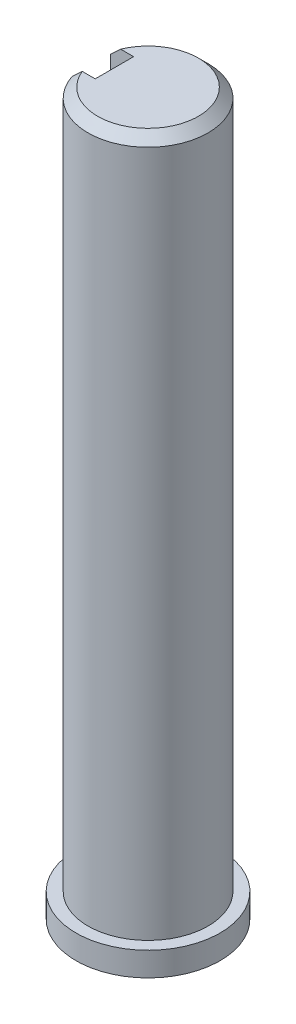
ISO-10303-21;
HEADER;
FILE_DESCRIPTION(('STEP AP214'),'2;1');
FILE_NAME('part.step','',(''),(''),'','','');
FILE_SCHEMA(('AUTOMOTIVE_DESIGN { 1 0 10303 214 1 1 1 1 }'));
ENDSEC;
DATA;
#1=APPLICATION_CONTEXT('core data for automotive mechanical design processes');
#2=APPLICATION_PROTOCOL_DEFINITION('international standard','automotive_design',2000,#1);
#3=PRODUCT_CONTEXT('',#1,'mechanical');
#4=PRODUCT('Part','Part','',(#3));
#5=PRODUCT_RELATED_PRODUCT_CATEGORY('part','',(#4));
#6=PRODUCT_DEFINITION_FORMATION('','',#4);
#7=PRODUCT_DEFINITION_CONTEXT('part definition',#1,'design');
#8=PRODUCT_DEFINITION('design','',#6,#7);
#9=PRODUCT_DEFINITION_SHAPE('','',#8);
#10=(LENGTH_UNIT() NAMED_UNIT(*) SI_UNIT(.MILLI.,.METRE.));
#11=(NAMED_UNIT(*) PLANE_ANGLE_UNIT() SI_UNIT($,.RADIAN.));
#12=(NAMED_UNIT(*) SI_UNIT($,.STERADIAN.) SOLID_ANGLE_UNIT());
#13=UNCERTAINTY_MEASURE_WITH_UNIT(LENGTH_MEASURE(1.E-05),#10,'distance_accuracy_value','');
#14=(GEOMETRIC_REPRESENTATION_CONTEXT(3) GLOBAL_UNCERTAINTY_ASSIGNED_CONTEXT((#13)) GLOBAL_UNIT_ASSIGNED_CONTEXT((#10,
#11,#12)) REPRESENTATION_CONTEXT('',''));
#15=CARTESIAN_POINT('',(0.,0.,0.));
#16=DIRECTION('',(0.,0.,1.));
#17=DIRECTION('',(1.,0.,0.));
#18=AXIS2_PLACEMENT_3D('',#15,#16,#17);
#19=CARTESIAN_POINT('',(0.,150.,0.));
#20=DIRECTION('',(0.,1.,0.));
#21=DIRECTION('',(0.,0.,1.));
#22=AXIS2_PLACEMENT_3D('',#19,#20,#21);
#23=PLANE('',#22);
#24=DIRECTION('',(1.,0.,0.));
#25=VECTOR('',#24,1.);
#26=CARTESIAN_POINT('',(-7.,150.,4.));
#27=LINE('',#26,#25);
#28=CARTESIAN_POINT('',(-9.70824391947378,150.,4.));
#29=VERTEX_POINT('',#28);
#30=CARTESIAN_POINT('',(-7.,150.,4.));
#31=VERTEX_POINT('',#30);
#32=EDGE_CURVE('E101',#29,#31,#27,.T.);
#33=ORIENTED_EDGE('',*,*,#32,.F.);
#34=CARTESIAN_POINT('',(0.,150.,0.));
#35=DIRECTION('',(0.,1.,0.));
#36=DIRECTION('',(0.,0.,1.));
#37=AXIS2_PLACEMENT_3D('',#34,#35,#36);
#38=CIRCLE('',#37,10.5);
#39=CARTESIAN_POINT('',(-9.70824391947378,150.,-4.));
#40=VERTEX_POINT('',#39);
#41=EDGE_CURVE('E48',#29,#40,#38,.T.);
#42=ORIENTED_EDGE('',*,*,#41,.T.);
#43=DIRECTION('',(-1.,0.,0.));
#44=VECTOR('',#43,1.);
#45=CARTESIAN_POINT('',(-7.,150.,-4.));
#46=LINE('',#45,#44);
#47=CARTESIAN_POINT('',(-7.,150.,-4.));
#48=VERTEX_POINT('',#47);
#49=EDGE_CURVE('E96',#48,#40,#46,.T.);
#50=ORIENTED_EDGE('',*,*,#49,.F.);
#51=DIRECTION('',(0.,0.,-1.));
#52=VECTOR('',#51,1.);
#53=CARTESIAN_POINT('',(-7.,150.,-4.));
#54=LINE('',#53,#52);
#55=EDGE_CURVE('E113',#31,#48,#54,.T.);
#56=ORIENTED_EDGE('',*,*,#55,.F.);
#57=EDGE_LOOP('',(#33,#42,#50,#56));
#58=FACE_BOUND('',#57,.T.);
#59=ADVANCED_FACE('F35',(#58),#23,.T.);
#60=CARTESIAN_POINT('',(0.,0.,0.));
#61=DIRECTION('',(0.,-1.,0.));
#62=DIRECTION('',(0.,0.,-1.));
#63=AXIS2_PLACEMENT_3D('',#60,#61,#62);
#64=CYLINDRICAL_SURFACE('',#63,12.5);
#65=DIRECTION('',(0.,-1.,0.));
#66=VECTOR('',#65,1.);
#67=CARTESIAN_POINT('',(-11.842719282327,0.,-4.));
#68=LINE('',#67,#66);
#69=CARTESIAN_POINT('',(-11.842719282327,148.,-4.));
#70=VERTEX_POINT('',#69);
#71=CARTESIAN_POINT('',(-11.842719282327,130.,-4.));
#72=VERTEX_POINT('',#71);
#73=EDGE_CURVE('E129',#70,#72,#68,.T.);
#74=ORIENTED_EDGE('',*,*,#73,.F.);
#75=CARTESIAN_POINT('',(0.,148.,0.));
#76=DIRECTION('',(0.,1.,0.));
#77=DIRECTION('',(0.,0.,1.));
#78=AXIS2_PLACEMENT_3D('',#75,#76,#77);
#79=CIRCLE('',#78,12.5);
#80=CARTESIAN_POINT('',(-11.842719282327,148.,4.));
#81=VERTEX_POINT('',#80);
#82=EDGE_CURVE('E131',#70,#81,#79,.F.);
#83=ORIENTED_EDGE('',*,*,#82,.T.);
#84=DIRECTION('',(0.,-1.,0.));
#85=VECTOR('',#84,1.);
#86=CARTESIAN_POINT('',(-11.842719282327,0.,4.));
#87=LINE('',#86,#85);
#88=CARTESIAN_POINT('',(-11.842719282327,130.,4.));
#89=VERTEX_POINT('',#88);
#90=EDGE_CURVE('E127',#89,#81,#87,.F.);
#91=ORIENTED_EDGE('',*,*,#90,.F.);
#92=CARTESIAN_POINT('',(0.,130.,0.));
#93=DIRECTION('',(0.,-1.,0.));
#94=DIRECTION('',(0.,0.,-1.));
#95=AXIS2_PLACEMENT_3D('',#92,#93,#94);
#96=CIRCLE('',#95,12.5);
#97=EDGE_CURVE('E94',#72,#89,#96,.F.);
#98=ORIENTED_EDGE('',*,*,#97,.F.);
#99=EDGE_LOOP('',(#74,#83,#91,#98));
#100=FACE_BOUND('',#99,.T.);
#101=CARTESIAN_POINT('',(0.,5.,0.));
#102=DIRECTION('',(0.,-1.,0.));
#103=DIRECTION('',(0.,0.,-1.));
#104=AXIS2_PLACEMENT_3D('',#101,#102,#103);
#105=CIRCLE('',#104,12.5);
#106=CARTESIAN_POINT('',(0.,5.,-12.5));
#107=VERTEX_POINT('',#106);
#108=EDGE_CURVE('E123',#107,#107,#105,.T.);
#109=ORIENTED_EDGE('',*,*,#108,.F.);
#110=EDGE_LOOP('',(#109));
#111=FACE_BOUND('',#110,.T.);
#112=ADVANCED_FACE('F154',(#100,#111),#64,.T.);
#113=CARTESIAN_POINT('',(12.5,5.,0.));
#114=DIRECTION('',(0.,1.,0.));
#115=DIRECTION('',(0.,0.,1.));
#116=AXIS2_PLACEMENT_3D('',#113,#114,#115);
#117=PLANE('',#116);
#118=ORIENTED_EDGE('',*,*,#108,.T.);
#119=EDGE_LOOP('',(#118));
#120=FACE_BOUND('',#119,.T.);
#121=CARTESIAN_POINT('',(0.,5.,0.));
#122=DIRECTION('',(0.,-1.,0.));
#123=DIRECTION('',(0.,0.,-1.));
#124=AXIS2_PLACEMENT_3D('',#121,#122,#123);
#125=CIRCLE('',#124,15.);
#126=CARTESIAN_POINT('',(0.,5.,-15.));
#127=VERTEX_POINT('',#126);
#128=EDGE_CURVE('E120',#127,#127,#125,.T.);
#129=ORIENTED_EDGE('',*,*,#128,.F.);
#130=EDGE_LOOP('',(#129));
#131=FACE_BOUND('',#130,.T.);
#132=ADVANCED_FACE('F150',(#120,#131),#117,.T.);
#133=CARTESIAN_POINT('',(0.,0.,0.));
#134=DIRECTION('',(0.,-1.,0.));
#135=DIRECTION('',(0.,0.,-1.));
#136=AXIS2_PLACEMENT_3D('',#133,#134,#135);
#137=CYLINDRICAL_SURFACE('',#136,15.);
#138=ORIENTED_EDGE('',*,*,#128,.T.);
#139=EDGE_LOOP('',(#138));
#140=FACE_BOUND('',#139,.T.);
#141=CARTESIAN_POINT('',(0.,0.,0.));
#142=DIRECTION('',(0.,-1.,0.));
#143=DIRECTION('',(0.,0.,-1.));
#144=AXIS2_PLACEMENT_3D('',#141,#142,#143);
#145=CIRCLE('',#144,15.);
#146=CARTESIAN_POINT('',(0.,0.,-15.));
#147=VERTEX_POINT('',#146);
#148=EDGE_CURVE('E116',#147,#147,#145,.T.);
#149=ORIENTED_EDGE('',*,*,#148,.F.);
#150=EDGE_LOOP('',(#149));
#151=FACE_BOUND('',#150,.T.);
#152=ADVANCED_FACE('F146',(#140,#151),#137,.T.);
#153=CARTESIAN_POINT('',(15.,0.,0.));
#154=DIRECTION('',(0.,-1.,0.));
#155=DIRECTION('',(0.,0.,-1.));
#156=AXIS2_PLACEMENT_3D('',#153,#154,#155);
#157=PLANE('',#156);
#158=ORIENTED_EDGE('',*,*,#148,.T.);
#159=EDGE_LOOP('',(#158));
#160=FACE_BOUND('',#159,.T.);
#161=ADVANCED_FACE('F142',(#160),#157,.T.);
#162=CARTESIAN_POINT('',(-7.,130.,-4.));
#163=DIRECTION('',(0.,0.,-1.));
#164=DIRECTION('',(-1.,0.,0.));
#165=AXIS2_PLACEMENT_3D('',#162,#163,#164);
#166=PLANE('',#165);
#167=ORIENTED_EDGE('',*,*,#49,.T.);
#168=CARTESIAN_POINT('',(-9.70824391947378,150.,-4.));
#169=CARTESIAN_POINT('',(-9.88722010334566,149.834513978711,-4.));
#170=CARTESIAN_POINT('',(-10.0658705790977,149.668676355117,-4.));
#171=CARTESIAN_POINT('',(-10.4225960083038,149.336386429758,-4.));
#172=CARTESIAN_POINT('',(-10.6006709669965,149.169934133618,-4.));
#173=CARTESIAN_POINT('',(-10.9563241273019,148.836500734032,-4.));
#174=CARTESIAN_POINT('',(-11.1339023300128,148.669519631757,-4.));
#175=CARTESIAN_POINT('',(-11.4886231325793,148.335092096713,-4.));
#176=CARTESIAN_POINT('',(-11.6657657284495,148.167645659717,-4.));
#177=CARTESIAN_POINT('',(-11.842719282327,148.,-4.));
#178=B_SPLINE_CURVE_WITH_KNOTS('',3,(#168,#169,#170,#171,#172,#173,#174,#175,#176,#177),
.UNSPECIFIED.,.F.,.F.,(4,2,2,2,4),(0.,0.731273718905164,1.46254076245574,2.1938061881556,
2.92507827957976),.UNSPECIFIED.);
#179=EDGE_CURVE('E11',#40,#70,#178,.T.);
#180=ORIENTED_EDGE('',*,*,#179,.T.);
#181=ORIENTED_EDGE('',*,*,#73,.T.);
#182=DIRECTION('',(-1.,0.,0.));
#183=VECTOR('',#182,1.);
#184=CARTESIAN_POINT('',(-7.,130.,-4.));
#185=LINE('',#184,#183);
#186=CARTESIAN_POINT('',(-7.,130.,-4.));
#187=VERTEX_POINT('',#186);
#188=EDGE_CURVE('E106',#187,#72,#185,.T.);
#189=ORIENTED_EDGE('',*,*,#188,.F.);
#190=DIRECTION('',(0.,1.,0.));
#191=VECTOR('',#190,1.);
#192=CARTESIAN_POINT('',(-7.,130.,-4.));
#193=LINE('',#192,#191);
#194=EDGE_CURVE('E105',#187,#48,#193,.T.);
#195=ORIENTED_EDGE('',*,*,#194,.T.);
#196=EDGE_LOOP('',(#167,#180,#181,#189,#195));
#197=FACE_BOUND('',#196,.T.);
#198=ADVANCED_FACE('F145',(#197),#166,.F.);
#199=CARTESIAN_POINT('',(-7.,130.,-4.));
#200=DIRECTION('',(1.,0.,0.));
#201=DIRECTION('',(0.,0.,-1.));
#202=AXIS2_PLACEMENT_3D('',#199,#200,#201);
#203=PLANE('',#202);
#204=ORIENTED_EDGE('',*,*,#55,.T.);
#205=ORIENTED_EDGE('',*,*,#194,.F.);
#206=DIRECTION('',(0.,0.,-1.));
#207=VECTOR('',#206,1.);
#208=CARTESIAN_POINT('',(-7.,130.,-4.));
#209=LINE('',#208,#207);
#210=CARTESIAN_POINT('',(-7.,130.,4.));
#211=VERTEX_POINT('',#210);
#212=EDGE_CURVE('E91',#211,#187,#209,.T.);
#213=ORIENTED_EDGE('',*,*,#212,.F.);
#214=DIRECTION('',(0.,1.,0.));
#215=VECTOR('',#214,1.);
#216=CARTESIAN_POINT('',(-7.,130.,4.));
#217=LINE('',#216,#215);
#218=EDGE_CURVE('E99',#211,#31,#217,.T.);
#219=ORIENTED_EDGE('',*,*,#218,.T.);
#220=EDGE_LOOP('',(#204,#205,#213,#219));
#221=FACE_BOUND('',#220,.T.);
#222=ADVANCED_FACE('F108',(#221),#203,.F.);
#223=CARTESIAN_POINT('',(-7.,130.,4.));
#224=DIRECTION('',(0.,0.,1.));
#225=DIRECTION('',(1.,0.,0.));
#226=AXIS2_PLACEMENT_3D('',#223,#224,#225);
#227=PLANE('',#226);
#228=ORIENTED_EDGE('',*,*,#90,.T.);
#229=CARTESIAN_POINT('',(-11.842719282327,148.,4.));
#230=CARTESIAN_POINT('',(-11.6657657284495,148.167645659717,4.));
#231=CARTESIAN_POINT('',(-11.4886231325793,148.335092096713,4.));
#232=CARTESIAN_POINT('',(-11.1339023300128,148.669519631757,4.));
#233=CARTESIAN_POINT('',(-10.9563241273019,148.836500734032,4.));
#234=CARTESIAN_POINT('',(-10.6006709669965,149.169934133618,4.));
#235=CARTESIAN_POINT('',(-10.4225960083038,149.336386429758,4.));
#236=CARTESIAN_POINT('',(-10.0658705790977,149.668676355117,4.));
#237=CARTESIAN_POINT('',(-9.88722010334564,149.834513978711,4.));
#238=CARTESIAN_POINT('',(-9.70824391947378,150.,4.));
#239=B_SPLINE_CURVE_WITH_KNOTS('',3,(#229,#230,#231,#232,#233,#234,#235,#236,#237,#238),
.UNSPECIFIED.,.F.,.F.,(4,2,2,2,4),(0.,0.731272091424167,1.46253751712405,2.19380456067461,
2.92507827957976),.UNSPECIFIED.);
#240=EDGE_CURVE('E62',#81,#29,#239,.T.);
#241=ORIENTED_EDGE('',*,*,#240,.T.);
#242=ORIENTED_EDGE('',*,*,#32,.T.);
#243=ORIENTED_EDGE('',*,*,#218,.F.);
#244=DIRECTION('',(1.,0.,0.));
#245=VECTOR('',#244,1.);
#246=CARTESIAN_POINT('',(-7.,130.,4.));
#247=LINE('',#246,#245);
#248=EDGE_CURVE('E86',#89,#211,#247,.T.);
#249=ORIENTED_EDGE('',*,*,#248,.F.);
#250=EDGE_LOOP('',(#228,#241,#242,#243,#249));
#251=FACE_BOUND('',#250,.T.);
#252=ADVANCED_FACE('F100',(#251),#227,.F.);
#253=CARTESIAN_POINT('',(0.,130.,0.));
#254=DIRECTION('',(0.,-1.,0.));
#255=DIRECTION('',(0.,0.,-1.));
#256=AXIS2_PLACEMENT_3D('',#253,#254,#255);
#257=PLANE('',#256);
#258=ORIENTED_EDGE('',*,*,#97,.T.);
#259=ORIENTED_EDGE('',*,*,#248,.T.);
#260=ORIENTED_EDGE('',*,*,#212,.T.);
#261=ORIENTED_EDGE('',*,*,#188,.T.);
#262=EDGE_LOOP('',(#258,#259,#260,#261));
#263=FACE_BOUND('',#262,.T.);
#264=ADVANCED_FACE('F88',(#263),#257,.F.);
#265=CARTESIAN_POINT('',(0.,148.,0.));
#266=DIRECTION('',(0.,-1.,0.));
#267=DIRECTION('',(0.,0.,-1.));
#268=AXIS2_PLACEMENT_3D('',#265,#266,#267);
#269=CONICAL_SURFACE('',#268,12.5,0.785398163397447);
#270=ORIENTED_EDGE('',*,*,#179,.F.);
#271=ORIENTED_EDGE('',*,*,#41,.F.);
#272=ORIENTED_EDGE('',*,*,#240,.F.);
#273=ORIENTED_EDGE('',*,*,#82,.F.);
#274=EDGE_LOOP('',(#270,#271,#272,#273));
#275=FACE_BOUND('',#274,.T.);
#276=ADVANCED_FACE('F37',(#275),#269,.T.);
#277=CLOSED_SHELL('',(#59,#112,#132,#152,#161,#198,#222,#252,#264,#276));
#278=MANIFOLD_SOLID_BREP('B2',#277);
#279=ADVANCED_BREP_SHAPE_REPRESENTATION('',(#18,#278),#14);
#280=SHAPE_DEFINITION_REPRESENTATION(#9,#279);
ENDSEC;
END-ISO-10303-21;
